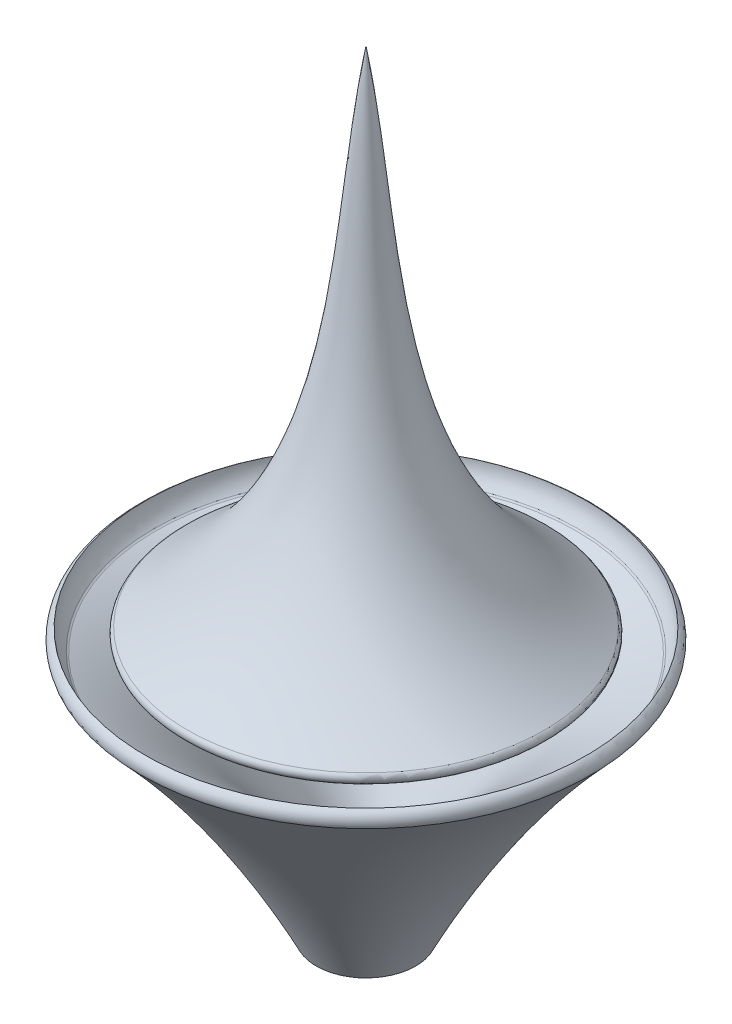
ISO-10303-21;
HEADER;
FILE_DESCRIPTION(('STEP AP214'),'2;1');
FILE_NAME('part.step','',(''),(''),'','','');
FILE_SCHEMA(('AUTOMOTIVE_DESIGN { 1 0 10303 214 1 1 1 1 }'));
ENDSEC;
DATA;
#1=APPLICATION_CONTEXT('core data for automotive mechanical design processes');
#2=APPLICATION_PROTOCOL_DEFINITION('international standard','automotive_design',2000,#1);
#3=PRODUCT_CONTEXT('',#1,'mechanical');
#4=PRODUCT('Part','Part','',(#3));
#5=PRODUCT_RELATED_PRODUCT_CATEGORY('part','',(#4));
#6=PRODUCT_DEFINITION_FORMATION('','',#4);
#7=PRODUCT_DEFINITION_CONTEXT('part definition',#1,'design');
#8=PRODUCT_DEFINITION('design','',#6,#7);
#9=PRODUCT_DEFINITION_SHAPE('','',#8);
#10=(LENGTH_UNIT() NAMED_UNIT(*) SI_UNIT(.MILLI.,.METRE.));
#11=(NAMED_UNIT(*) PLANE_ANGLE_UNIT() SI_UNIT($,.RADIAN.));
#12=(NAMED_UNIT(*) SI_UNIT($,.STERADIAN.) SOLID_ANGLE_UNIT());
#13=UNCERTAINTY_MEASURE_WITH_UNIT(LENGTH_MEASURE(1.E-05),#10,'distance_accuracy_value','');
#14=(GEOMETRIC_REPRESENTATION_CONTEXT(3) GLOBAL_UNCERTAINTY_ASSIGNED_CONTEXT((#13)) GLOBAL_UNIT_ASSIGNED_CONTEXT((#10,
#11,#12)) REPRESENTATION_CONTEXT('',''));
#15=CARTESIAN_POINT('',(0.,0.,0.));
#16=DIRECTION('',(0.,0.,1.));
#17=DIRECTION('',(1.,0.,0.));
#18=AXIS2_PLACEMENT_3D('',#15,#16,#17);
#19=CARTESIAN_POINT('',(-38.6527179046623,-0.809007246357066,0.));
#20=CARTESIAN_POINT('',(-20.4080349785534,-20.2060423607741,0.));
#21=CARTESIAN_POINT('',(-8.53464632420725,-44.2877106625418,0.));
#22=B_SPLINE_CURVE_WITH_KNOTS('',2,(#19,#20,#21),.UNSPECIFIED.,.F.,.F.,(3,3),(0.,1.),.UNSPECIFIED.);
#23=CARTESIAN_POINT('',(0.,0.,0.));
#24=DIRECTION('',(0.,-1.,0.));
#25=AXIS1_PLACEMENT('',#23,#24);
#26=SURFACE_OF_REVOLUTION('',#22,#25);
#27=CARTESIAN_POINT('',(0.,-44.2877106625418,0.));
#28=DIRECTION('',(0.,-1.,0.));
#29=DIRECTION('',(0.,0.,-1.));
#30=AXIS2_PLACEMENT_3D('',#27,#28,#29);
#31=CIRCLE('',#30,8.53464632420725);
#32=CARTESIAN_POINT('',(0.,-44.2877106625418,-8.53464632420725));
#33=VERTEX_POINT('',#32);
#34=EDGE_CURVE('E73',#33,#33,#31,.T.);
#35=ORIENTED_EDGE('',*,*,#34,.F.);
#36=EDGE_LOOP('',(#35));
#37=FACE_BOUND('',#36,.T.);
#38=CARTESIAN_POINT('',(0.,-0.809007246357066,0.));
#39=DIRECTION('',(0.,-1.,0.));
#40=DIRECTION('',(0.,0.,-1.));
#41=AXIS2_PLACEMENT_3D('',#38,#39,#40);
#42=CIRCLE('',#41,38.6527179046623);
#43=CARTESIAN_POINT('',(0.,-0.809007246357066,-38.6527179046623));
#44=VERTEX_POINT('',#43);
#45=EDGE_CURVE('E79',#44,#44,#42,.T.);
#46=ORIENTED_EDGE('',*,*,#45,.T.);
#47=EDGE_LOOP('',(#46));
#48=FACE_BOUND('',#47,.T.);
#49=ADVANCED_FACE('F47',(#37,#48),#26,.T.);
#50=CARTESIAN_POINT('',(-8.53464632420725,-44.2877106625418,0.));
#51=DIRECTION('',(0.,1.,0.));
#52=DIRECTION('',(0.,0.,1.));
#53=AXIS2_PLACEMENT_3D('',#50,#51,#52);
#54=PLANE('',#53);
#55=CARTESIAN_POINT('',(0.,-44.2877106625418,0.));
#56=DIRECTION('',(0.,1.,0.));
#57=DIRECTION('',(0.,0.,1.));
#58=AXIS2_PLACEMENT_3D('',#55,#56,#57);
#59=CIRCLE('',#58,4.52400975523828);
#60=CARTESIAN_POINT('',(0.,-44.2877106625418,4.52400975523828));
#61=VERTEX_POINT('',#60);
#62=EDGE_CURVE('E62',#61,#61,#59,.T.);
#63=ORIENTED_EDGE('',*,*,#62,.T.);
#64=EDGE_LOOP('',(#63));
#65=FACE_BOUND('',#64,.T.);
#66=ORIENTED_EDGE('',*,*,#34,.T.);
#67=EDGE_LOOP('',(#66));
#68=FACE_BOUND('',#67,.T.);
#69=ADVANCED_FACE('F105',(#65,#68),#54,.F.);
#70=CARTESIAN_POINT('',(0.,0.,0.));
#71=DIRECTION('',(0.,-1.,0.));
#72=DIRECTION('',(0.,0.,-1.));
#73=AXIS2_PLACEMENT_3D('',#70,#71,#72);
#74=CYLINDRICAL_SURFACE('',#73,3.52400975523828);
#75=CARTESIAN_POINT('',(0.,-43.2877106625418,0.));
#76=DIRECTION('',(0.,1.,0.));
#77=DIRECTION('',(0.,0.,1.));
#78=AXIS2_PLACEMENT_3D('',#75,#76,#77);
#79=CIRCLE('',#78,3.52400975523828);
#80=CARTESIAN_POINT('',(0.,-43.2877106625418,3.52400975523828));
#81=VERTEX_POINT('',#80);
#82=EDGE_CURVE('E67',#81,#81,#79,.F.);
#83=ORIENTED_EDGE('',*,*,#82,.T.);
#84=EDGE_LOOP('',(#83));
#85=FACE_BOUND('',#84,.T.);
#86=CARTESIAN_POINT('',(0.,-36.1561537052117,0.));
#87=DIRECTION('',(0.,1.,0.));
#88=DIRECTION('',(0.,0.,1.));
#89=AXIS2_PLACEMENT_3D('',#86,#87,#88);
#90=CIRCLE('',#89,3.52400975523828);
#91=CARTESIAN_POINT('',(0.,-36.1561537052117,3.52400975523828));
#92=VERTEX_POINT('',#91);
#93=EDGE_CURVE('E70',#92,#92,#90,.T.);
#94=ORIENTED_EDGE('',*,*,#93,.T.);
#95=EDGE_LOOP('',(#94));
#96=FACE_BOUND('',#95,.T.);
#97=ADVANCED_FACE('F102',(#85,#96),#74,.F.);
#98=CARTESIAN_POINT('',(-3.52400975523828,-35.9249043845808,0.));
#99=CARTESIAN_POINT('',(-4.44328363818736,-34.0369631973985,0.));
#100=CARTESIAN_POINT('',(-12.0139858832129,-19.8596848586756,0.));
#101=CARTESIAN_POINT('',(-23.7439096540907,-7.82050730966866,0.));
#102=CARTESIAN_POINT('',(-36.2496444996256,-1.84683182607044,0.));
#103=B_SPLINE_CURVE_WITH_KNOTS('',3,(#98,#99,#100,#101,#102),.UNSPECIFIED.,.F.,.F.,(4,1,4),(0.,
0.110255003584313,0.839930537538464),.UNSPECIFIED.);
#104=CARTESIAN_POINT('',(0.,0.,0.));
#105=DIRECTION('',(0.,-1.,0.));
#106=AXIS1_PLACEMENT('',#104,#105);
#107=SURFACE_OF_REVOLUTION('',#103,#106);
#108=CARTESIAN_POINT('',(0.,-35.7158841850783,0.));
#109=DIRECTION('',(0.,-1.,0.));
#110=DIRECTION('',(0.,0.,-1.));
#111=AXIS2_PLACEMENT_3D('',#108,#109,#110);
#112=CIRCLE('',#111,3.62614409176657);
#113=CARTESIAN_POINT('',(0.,-35.7158841850783,-3.62614409176657));
#114=VERTEX_POINT('',#113);
#115=EDGE_CURVE('E54',#114,#114,#112,.T.);
#116=ORIENTED_EDGE('',*,*,#115,.T.);
#117=EDGE_LOOP('',(#116));
#118=FACE_BOUND('',#117,.T.);
#119=CARTESIAN_POINT('',(0.,-1.91862119610979,0.));
#120=DIRECTION('',(0.,-1.,0.));
#121=DIRECTION('',(0.,0.,-1.));
#122=AXIS2_PLACEMENT_3D('',#119,#120,#121);
#123=CIRCLE('',#122,36.0999151186234);
#124=CARTESIAN_POINT('',(0.,-1.91862119610979,-36.0999151186234));
#125=VERTEX_POINT('',#124);
#126=EDGE_CURVE('E58',#125,#125,#123,.F.);
#127=ORIENTED_EDGE('',*,*,#126,.T.);
#128=EDGE_LOOP('',(#127));
#129=FACE_BOUND('',#128,.T.);
#130=ADVANCED_FACE('F99',(#118,#129),#107,.T.);
#131=CARTESIAN_POINT('',(-36.2496444996256,-1.84683182607044,0.));
#132=CARTESIAN_POINT('',(-37.7726904930953,-0.385439184192598,0.));
#133=CARTESIAN_POINT('',(-37.859600544502,1.68554812509987,0.));
#134=B_SPLINE_CURVE_WITH_KNOTS('',2,(#131,#132,#133),.UNSPECIFIED.,.F.,.F.,(3,3),(0.,1.),.UNSPECIFIED.);
#135=CARTESIAN_POINT('',(0.,0.,0.));
#136=DIRECTION('',(0.,-1.,0.));
#137=AXIS1_PLACEMENT('',#135,#136);
#138=SURFACE_OF_REVOLUTION('',#134,#137);
#139=CARTESIAN_POINT('',(0.,-1.71796239140907,0.));
#140=DIRECTION('',(0.,-1.,0.));
#141=DIRECTION('',(0.,0.,-1.));
#142=AXIS2_PLACEMENT_3D('',#139,#140,#141);
#143=CIRCLE('',#142,36.3799961065563);
#144=CARTESIAN_POINT('',(0.,-1.71796239140907,-36.3799961065563));
#145=VERTEX_POINT('',#144);
#146=EDGE_CURVE('E11',#145,#145,#143,.T.);
#147=ORIENTED_EDGE('',*,*,#146,.T.);
#148=EDGE_LOOP('',(#147));
#149=FACE_BOUND('',#148,.T.);
#150=CARTESIAN_POINT('',(0.,1.68554812509987,0.));
#151=DIRECTION('',(0.,-1.,0.));
#152=DIRECTION('',(0.,0.,-1.));
#153=AXIS2_PLACEMENT_3D('',#150,#151,#152);
#154=CIRCLE('',#153,37.859600544502);
#155=CARTESIAN_POINT('',(0.,1.68554812509987,-37.859600544502));
#156=VERTEX_POINT('',#155);
#157=EDGE_CURVE('E76',#156,#156,#154,.T.);
#158=ORIENTED_EDGE('',*,*,#157,.F.);
#159=EDGE_LOOP('',(#158));
#160=FACE_BOUND('',#159,.T.);
#161=ADVANCED_FACE('F94',(#149,#160),#138,.T.);
#162=CARTESIAN_POINT('',(0.,0.,0.));
#163=DIRECTION('',(0.,-1.,0.));
#164=DIRECTION('',(0.,0.,-1.));
#165=AXIS2_PLACEMENT_3D('',#162,#163,#164);
#166=TOROIDAL_SURFACE('',#165,36.8776874704603,1.95069878940898);
#167=ORIENTED_EDGE('',*,*,#45,.F.);
#168=EDGE_LOOP('',(#167));
#169=FACE_BOUND('',#168,.T.);
#170=ORIENTED_EDGE('',*,*,#157,.T.);
#171=EDGE_LOOP('',(#170));
#172=FACE_BOUND('',#171,.T.);
#173=ADVANCED_FACE('F98',(#169,#172),#166,.T.);
#174=CARTESIAN_POINT('',(0.,-43.2877106625418,0.));
#175=DIRECTION('',(0.,1.,0.));
#176=DIRECTION('',(0.,0.,1.));
#177=AXIS2_PLACEMENT_3D('',#174,#175,#176);
#178=TOROIDAL_SURFACE('',#177,4.52400975523828,1.);
#179=ORIENTED_EDGE('',*,*,#62,.F.);
#180=EDGE_LOOP('',(#179));
#181=FACE_BOUND('',#180,.T.);
#182=ORIENTED_EDGE('',*,*,#82,.F.);
#183=EDGE_LOOP('',(#182));
#184=FACE_BOUND('',#183,.T.);
#185=ADVANCED_FACE('F113',(#181,#184),#178,.T.);
#186=CARTESIAN_POINT('',(0.,-36.1561537052117,0.));
#187=DIRECTION('',(0.,1.,0.));
#188=DIRECTION('',(0.,0.,1.));
#189=AXIS2_PLACEMENT_3D('',#186,#187,#188);
#190=TOROIDAL_SURFACE('',#189,4.52400975523828,1.);
#191=ORIENTED_EDGE('',*,*,#93,.F.);
#192=EDGE_LOOP('',(#191));
#193=FACE_BOUND('',#192,.T.);
#194=ORIENTED_EDGE('',*,*,#115,.F.);
#195=EDGE_LOOP('',(#194));
#196=FACE_BOUND('',#195,.T.);
#197=ADVANCED_FACE('F121',(#193,#196),#190,.T.);
#198=CARTESIAN_POINT('',(0.,-1.0175374224134,0.));
#199=DIRECTION('',(0.,-1.,0.));
#200=DIRECTION('',(0.,0.,-1.));
#201=AXIS2_PLACEMENT_3D('',#198,#199,#200);
#202=TOROIDAL_SURFACE('',#201,35.6662700647121,1.);
#203=ORIENTED_EDGE('',*,*,#126,.F.);
#204=EDGE_LOOP('',(#203));
#205=FACE_BOUND('',#204,.T.);
#206=ORIENTED_EDGE('',*,*,#146,.F.);
#207=EDGE_LOOP('',(#206));
#208=FACE_BOUND('',#207,.T.);
#209=ADVANCED_FACE('F49',(#205,#208),#202,.F.);
#210=CLOSED_SHELL('',(#49,#69,#97,#130,#161,#173,#185,#197,#209));
#211=MANIFOLD_SOLID_BREP('B2',#210);
#212=CARTESIAN_POINT('',(-33.4622288819265,0.,0.));
#213=DIRECTION('',(0.,1.,0.));
#214=DIRECTION('',(0.,0.,1.));
#215=AXIS2_PLACEMENT_3D('',#212,#213,#214);
#216=PLANE('',#215);
#217=CARTESIAN_POINT('',(0.,0.,0.));
#218=DIRECTION('',(0.,1.,0.));
#219=DIRECTION('',(0.,0.,1.));
#220=AXIS2_PLACEMENT_3D('',#217,#218,#219);
#221=CIRCLE('',#220,30.0637495589517);
#222=CARTESIAN_POINT('',(0.,0.,30.0637495589517));
#223=VERTEX_POINT('',#222);
#224=EDGE_CURVE('E213',#223,#223,#221,.F.);
#225=ORIENTED_EDGE('',*,*,#224,.T.);
#226=EDGE_LOOP('',(#225));
#227=FACE_BOUND('',#226,.T.);
#228=ADVANCED_FACE('F205',(#227),#216,.F.);
#229=CARTESIAN_POINT('',(0.,88.2020706942084,0.));
#230=CARTESIAN_POINT('',(-5.40669583842255,57.5986680903507,0.));
#231=CARTESIAN_POINT('',(-1.67968521393301,19.1947996474888,0.));
#232=CARTESIAN_POINT('',(-33.4622288819265,0.,0.));
#233=B_SPLINE_CURVE_WITH_KNOTS('',3,(#229,#230,#231,#232),.UNSPECIFIED.,.F.,.F.,(4,4),(0.,1.),.UNSPECIFIED.);
#234=CARTESIAN_POINT('',(0.,0.,0.));
#235=DIRECTION('',(0.,-1.,0.));
#236=AXIS1_PLACEMENT('',#234,#235);
#237=SURFACE_OF_REVOLUTION('',#233,#236);
#238=CARTESIAN_POINT('',(0.,1.8243994603005,0.));
#239=DIRECTION('',(0.,-1.,0.));
#240=DIRECTION('',(0.,0.,-1.));
#241=AXIS2_PLACEMENT_3D('',#238,#239,#240);
#242=CIRCLE('',#241,30.62975797749);
#243=CARTESIAN_POINT('',(0.,1.8243994603005,-30.62975797749));
#244=VERTEX_POINT('',#243);
#245=EDGE_CURVE('E45',#244,#244,#242,.F.);
#246=ORIENTED_EDGE('',*,*,#245,.T.);
#247=EDGE_LOOP('',(#246));
#248=FACE_BOUND('',#247,.T.);
#249=CARTESIAN_POINT('',(0.,88.2020706942084,0.));
#250=VERTEX_POINT('',#249);
#251=VERTEX_LOOP('',#250);
#252=FACE_BOUND('',#251,.T.);
#253=ADVANCED_FACE('F216',(#248,#252),#237,.T.);
#254=CARTESIAN_POINT('',(0.,0.999999999999996,0.));
#255=DIRECTION('',(0.,-1.,0.));
#256=DIRECTION('',(0.,0.,-1.));
#257=AXIS2_PLACEMENT_3D('',#254,#255,#256);
#258=TOROIDAL_SURFACE('',#257,30.0637495589517,1.);
#259=ORIENTED_EDGE('',*,*,#245,.F.);
#260=EDGE_LOOP('',(#259));
#261=FACE_BOUND('',#260,.T.);
#262=ORIENTED_EDGE('',*,*,#224,.F.);
#263=EDGE_LOOP('',(#262));
#264=FACE_BOUND('',#263,.T.);
#265=ADVANCED_FACE('F207',(#261,#264),#258,.T.);
#266=CLOSED_SHELL('',(#228,#253,#265));
#267=MANIFOLD_SOLID_BREP('B6',#266);
#268=ADVANCED_BREP_SHAPE_REPRESENTATION('',(#18,#211,#267),#14);
#269=SHAPE_DEFINITION_REPRESENTATION(#9,#268);
ENDSEC;
END-ISO-10303-21;
